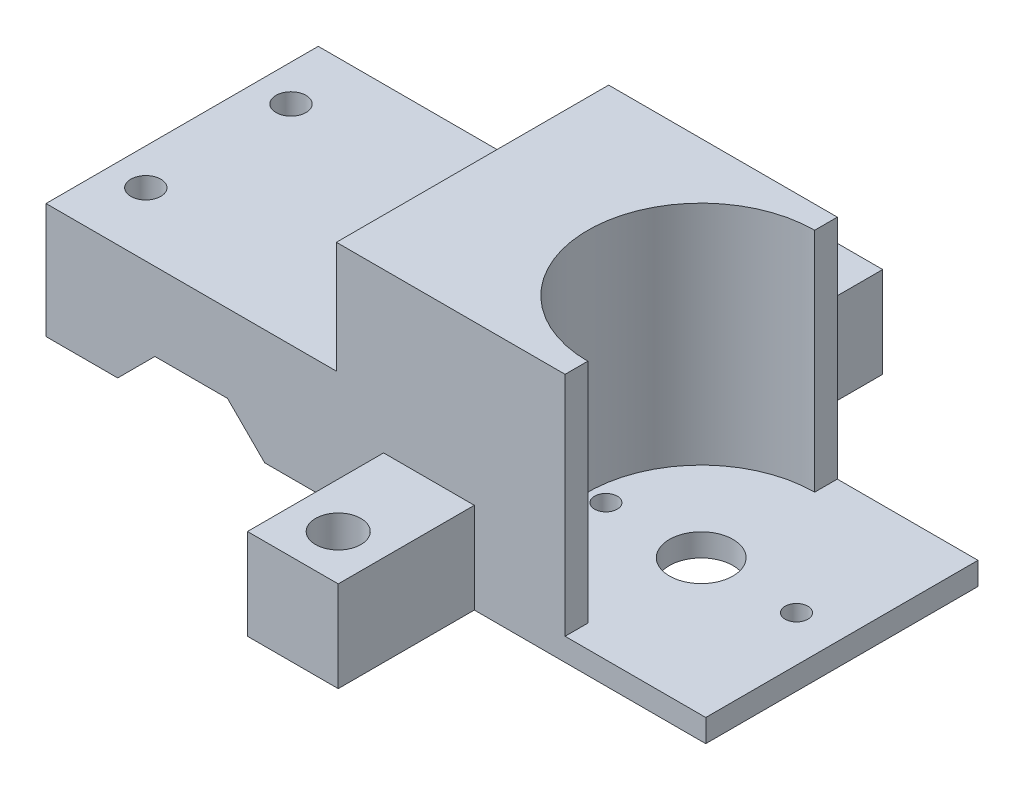
ISO-10303-21;
HEADER;
FILE_DESCRIPTION(('STEP AP214'),'2;1');
FILE_NAME('part.step','',(''),(''),'','','');
FILE_SCHEMA(('AUTOMOTIVE_DESIGN { 1 0 10303 214 1 1 1 1 }'));
ENDSEC;
DATA;
#1=APPLICATION_CONTEXT('core data for automotive mechanical design processes');
#2=APPLICATION_PROTOCOL_DEFINITION('international standard','automotive_design',2000,#1);
#3=PRODUCT_CONTEXT('',#1,'mechanical');
#4=PRODUCT('Part','Part','',(#3));
#5=PRODUCT_RELATED_PRODUCT_CATEGORY('part','',(#4));
#6=PRODUCT_DEFINITION_FORMATION('','',#4);
#7=PRODUCT_DEFINITION_CONTEXT('part definition',#1,'design');
#8=PRODUCT_DEFINITION('design','',#6,#7);
#9=PRODUCT_DEFINITION_SHAPE('','',#8);
#10=(LENGTH_UNIT() NAMED_UNIT(*) SI_UNIT(.MILLI.,.METRE.));
#11=(NAMED_UNIT(*) PLANE_ANGLE_UNIT() SI_UNIT($,.RADIAN.));
#12=(NAMED_UNIT(*) SI_UNIT($,.STERADIAN.) SOLID_ANGLE_UNIT());
#13=UNCERTAINTY_MEASURE_WITH_UNIT(LENGTH_MEASURE(1.E-05),#10,'distance_accuracy_value','');
#14=(GEOMETRIC_REPRESENTATION_CONTEXT(3) GLOBAL_UNCERTAINTY_ASSIGNED_CONTEXT((#13)) GLOBAL_UNIT_ASSIGNED_CONTEXT((#10,
#11,#12)) REPRESENTATION_CONTEXT('',''));
#15=CARTESIAN_POINT('',(0.,0.,0.));
#16=DIRECTION('',(0.,0.,1.));
#17=DIRECTION('',(1.,0.,0.));
#18=AXIS2_PLACEMENT_3D('',#15,#16,#17);
#19=CARTESIAN_POINT('',(0.,0.,-15.));
#20=DIRECTION('',(0.,0.,1.));
#21=DIRECTION('',(1.,0.,0.));
#22=AXIS2_PLACEMENT_3D('',#19,#20,#21);
#23=PLANE('',#22);
#24=DIRECTION('',(0.,-1.,0.));
#25=VECTOR('',#24,1.);
#26=CARTESIAN_POINT('',(31.2,7.49999999999998,-15.));
#27=LINE('',#26,#25);
#28=CARTESIAN_POINT('',(31.2,7.49999999999998,-15.));
#29=VERTEX_POINT('',#28);
#30=CARTESIAN_POINT('',(31.2,-2.50000000000002,-15.));
#31=VERTEX_POINT('',#30);
#32=EDGE_CURVE('E53',#29,#31,#27,.T.);
#33=ORIENTED_EDGE('',*,*,#32,.F.);
#34=DIRECTION('',(-1.,0.,0.));
#35=VECTOR('',#34,1.);
#36=CARTESIAN_POINT('',(21.2,7.49999999999999,-15.));
#37=LINE('',#36,#35);
#38=CARTESIAN_POINT('',(21.2,7.49999999999999,-15.));
#39=VERTEX_POINT('',#38);
#40=EDGE_CURVE('E58',#29,#39,#37,.T.);
#41=ORIENTED_EDGE('',*,*,#40,.T.);
#42=DIRECTION('',(0.,-1.,0.));
#43=VECTOR('',#42,1.);
#44=CARTESIAN_POINT('',(21.2,7.49999999999999,-15.));
#45=LINE('',#44,#43);
#46=CARTESIAN_POINT('',(21.2,0.,-15.));
#47=VERTEX_POINT('',#46);
#48=EDGE_CURVE('E207',#39,#47,#45,.T.);
#49=ORIENTED_EDGE('',*,*,#48,.T.);
#50=DIRECTION('',(1.,0.,0.));
#51=VECTOR('',#50,1.);
#52=CARTESIAN_POINT('',(0.,0.,-15.));
#53=LINE('',#52,#51);
#54=CARTESIAN_POINT('',(8.10121933088197,0.,-15.));
#55=VERTEX_POINT('',#54);
#56=EDGE_CURVE('E385',#55,#47,#53,.T.);
#57=ORIENTED_EDGE('',*,*,#56,.F.);
#58=DIRECTION('',(0.707106781186546,-0.707106781186549,0.));
#59=VECTOR('',#58,1.);
#60=CARTESIAN_POINT('',(4.050609665441,4.05060966544098,-15.));
#61=LINE('',#60,#59);
#62=CARTESIAN_POINT('',(4.,4.10121933088198,-15.));
#63=VERTEX_POINT('',#62);
#64=EDGE_CURVE('E383',#63,#55,#61,.T.);
#65=ORIENTED_EDGE('',*,*,#64,.F.);
#66=DIRECTION('',(1.,0.,0.));
#67=VECTOR('',#66,1.);
#68=CARTESIAN_POINT('',(0.,4.10121933088198,-15.));
#69=LINE('',#68,#67);
#70=CARTESIAN_POINT('',(-4.,4.10121933088198,-15.));
#71=VERTEX_POINT('',#70);
#72=EDGE_CURVE('E359',#71,#63,#69,.T.);
#73=ORIENTED_EDGE('',*,*,#72,.F.);
#74=DIRECTION('',(-0.707106781186546,-0.707106781186549,0.));
#75=VECTOR('',#74,1.);
#76=CARTESIAN_POINT('',(-4.050609665441,4.05060966544098,-15.));
#77=LINE('',#76,#75);
#78=CARTESIAN_POINT('',(-8.10121933088197,0.,-15.));
#79=VERTEX_POINT('',#78);
#80=EDGE_CURVE('E364',#71,#79,#77,.T.);
#81=ORIENTED_EDGE('',*,*,#80,.T.);
#82=DIRECTION('',(-1.,0.,0.));
#83=VECTOR('',#82,1.);
#84=CARTESIAN_POINT('',(0.,0.,-15.));
#85=LINE('',#84,#83);
#86=CARTESIAN_POINT('',(-16.,0.,-15.));
#87=VERTEX_POINT('',#86);
#88=EDGE_CURVE('E393',#79,#87,#85,.T.);
#89=ORIENTED_EDGE('',*,*,#88,.T.);
#90=DIRECTION('',(0.,1.,0.));
#91=VECTOR('',#90,1.);
#92=CARTESIAN_POINT('',(-16.,0.,-15.));
#93=LINE('',#92,#91);
#94=CARTESIAN_POINT('',(-16.,12.7,-15.));
#95=VERTEX_POINT('',#94);
#96=EDGE_CURVE('E390',#87,#95,#93,.T.);
#97=ORIENTED_EDGE('',*,*,#96,.T.);
#98=DIRECTION('',(-1.,0.,0.));
#99=VECTOR('',#98,1.);
#100=CARTESIAN_POINT('',(0.,12.7,-15.));
#101=LINE('',#100,#99);
#102=CARTESIAN_POINT('',(16.,12.7,-15.));
#103=VERTEX_POINT('',#102);
#104=EDGE_CURVE('E387',#103,#95,#101,.T.);
#105=ORIENTED_EDGE('',*,*,#104,.F.);
#106=DIRECTION('',(0.,1.,0.));
#107=VECTOR('',#106,1.);
#108=CARTESIAN_POINT('',(16.,0.,-15.));
#109=LINE('',#108,#107);
#110=CARTESIAN_POINT('',(16.,25.,-15.));
#111=VERTEX_POINT('',#110);
#112=EDGE_CURVE('E302',#103,#111,#109,.T.);
#113=ORIENTED_EDGE('',*,*,#112,.T.);
#114=DIRECTION('',(-1.,0.,0.));
#115=VECTOR('',#114,1.);
#116=CARTESIAN_POINT('',(41.2,25.,-15.));
#117=LINE('',#116,#115);
#118=CARTESIAN_POINT('',(41.2,25.,-15.));
#119=VERTEX_POINT('',#118);
#120=EDGE_CURVE('E332',#119,#111,#117,.T.);
#121=ORIENTED_EDGE('',*,*,#120,.F.);
#122=DIRECTION('',(0.,1.,0.));
#123=VECTOR('',#122,1.);
#124=CARTESIAN_POINT('',(41.2,0.,-15.));
#125=LINE('',#124,#123);
#126=CARTESIAN_POINT('',(41.2,0.,-15.));
#127=VERTEX_POINT('',#126);
#128=EDGE_CURVE('E309',#127,#119,#125,.T.);
#129=ORIENTED_EDGE('',*,*,#128,.F.);
#130=DIRECTION('',(1.,0.,0.));
#131=VECTOR('',#130,1.);
#132=CARTESIAN_POINT('',(21.2,0.,-15.));
#133=LINE('',#132,#131);
#134=CARTESIAN_POINT('',(56.7,0.,-15.));
#135=VERTEX_POINT('',#134);
#136=EDGE_CURVE('E287',#127,#135,#133,.T.);
#137=ORIENTED_EDGE('',*,*,#136,.T.);
#138=DIRECTION('',(0.,1.,0.));
#139=VECTOR('',#138,1.);
#140=CARTESIAN_POINT('',(56.7,-2.50000000000003,-15.));
#141=LINE('',#140,#139);
#142=CARTESIAN_POINT('',(56.7,-2.50000000000003,-15.));
#143=VERTEX_POINT('',#142);
#144=EDGE_CURVE('E295',#143,#135,#141,.T.);
#145=ORIENTED_EDGE('',*,*,#144,.F.);
#146=DIRECTION('',(1.,0.,0.));
#147=VECTOR('',#146,1.);
#148=CARTESIAN_POINT('',(21.2,-2.50000000000001,-15.));
#149=LINE('',#148,#147);
#150=EDGE_CURVE('E277',#31,#143,#149,.T.);
#151=ORIENTED_EDGE('',*,*,#150,.F.);
#152=EDGE_LOOP('',(#33,#41,#49,#57,#65,#73,#81,#89,#97,#105,#113,#121,#129,#137,#145,#151));
#153=FACE_BOUND('',#152,.T.);
#154=ADVANCED_FACE('F38',(#153),#23,.F.);
#155=CARTESIAN_POINT('',(0.,0.,15.));
#156=DIRECTION('',(0.,1.,0.));
#157=DIRECTION('',(-1.,0.,0.));
#158=AXIS2_PLACEMENT_3D('',#155,#156,#157);
#159=PLANE('',#158);
#160=CARTESIAN_POINT('',(12.,0.,-8.));
#161=DIRECTION('',(0.,-1.,0.));
#162=DIRECTION('',(1.,0.,0.));
#163=AXIS2_PLACEMENT_3D('',#160,#161,#162);
#164=CIRCLE('',#163,1.65);
#165=CARTESIAN_POINT('',(13.65,0.,-8.));
#166=VERTEX_POINT('',#165);
#167=EDGE_CURVE('E356',#166,#166,#164,.F.);
#168=ORIENTED_EDGE('',*,*,#167,.T.);
#169=EDGE_LOOP('',(#168));
#170=FACE_BOUND('',#169,.T.);
#171=CARTESIAN_POINT('',(12.,0.,8.));
#172=DIRECTION('',(0.,-1.,0.));
#173=DIRECTION('',(1.,0.,0.));
#174=AXIS2_PLACEMENT_3D('',#171,#172,#173);
#175=CIRCLE('',#174,1.65);
#176=CARTESIAN_POINT('',(13.65,0.,8.));
#177=VERTEX_POINT('',#176);
#178=EDGE_CURVE('E339',#177,#177,#175,.F.);
#179=ORIENTED_EDGE('',*,*,#178,.T.);
#180=EDGE_LOOP('',(#179));
#181=FACE_BOUND('',#180,.T.);
#182=DIRECTION('',(0.,0.,-1.));
#183=VECTOR('',#182,1.);
#184=CARTESIAN_POINT('',(21.2,0.,-15.));
#185=LINE('',#184,#183);
#186=CARTESIAN_POINT('',(21.2,0.,15.));
#187=VERTEX_POINT('',#186);
#188=EDGE_CURVE('E272',#187,#47,#185,.T.);
#189=ORIENTED_EDGE('',*,*,#188,.F.);
#190=DIRECTION('',(1.,0.,0.));
#191=VECTOR('',#190,1.);
#192=CARTESIAN_POINT('',(0.,0.,15.));
#193=LINE('',#192,#191);
#194=CARTESIAN_POINT('',(8.10121933088197,0.,15.));
#195=VERTEX_POINT('',#194);
#196=EDGE_CURVE('E366',#195,#187,#193,.T.);
#197=ORIENTED_EDGE('',*,*,#196,.F.);
#198=DIRECTION('',(0.,0.,-1.));
#199=VECTOR('',#198,1.);
#200=CARTESIAN_POINT('',(8.10121933088197,0.,15.));
#201=LINE('',#200,#199);
#202=EDGE_CURVE('E46',#195,#55,#201,.T.);
#203=ORIENTED_EDGE('',*,*,#202,.T.);
#204=ORIENTED_EDGE('',*,*,#56,.T.);
#205=EDGE_LOOP('',(#189,#197,#203,#204));
#206=FACE_BOUND('',#205,.T.);
#207=ADVANCED_FACE('F413',(#170,#181,#206),#159,.F.);
#208=CARTESIAN_POINT('',(41.2,0.,0.));
#209=DIRECTION('',(1.,0.,0.));
#210=DIRECTION('',(0.,1.,0.));
#211=AXIS2_PLACEMENT_3D('',#208,#209,#210);
#212=PLANE('',#211);
#213=DIRECTION('',(0.,1.,0.));
#214=VECTOR('',#213,1.);
#215=CARTESIAN_POINT('',(41.2,-27.9508497187474,-12.5));
#216=LINE('',#215,#214);
#217=CARTESIAN_POINT('',(41.2,0.,-12.5));
#218=VERTEX_POINT('',#217);
#219=CARTESIAN_POINT('',(41.2,25.,-12.5));
#220=VERTEX_POINT('',#219);
#221=EDGE_CURVE('E303',#218,#220,#216,.T.);
#222=ORIENTED_EDGE('',*,*,#221,.F.);
#223=DIRECTION('',(0.,0.,-1.));
#224=VECTOR('',#223,1.);
#225=CARTESIAN_POINT('',(41.2,0.,-15.));
#226=LINE('',#225,#224);
#227=EDGE_CURVE('E320',#218,#127,#226,.T.);
#228=ORIENTED_EDGE('',*,*,#227,.T.);
#229=ORIENTED_EDGE('',*,*,#128,.T.);
#230=DIRECTION('',(0.,0.,1.));
#231=VECTOR('',#230,1.);
#232=CARTESIAN_POINT('',(41.2,25.,-15.));
#233=LINE('',#232,#231);
#234=EDGE_CURVE('E314',#119,#220,#233,.T.);
#235=ORIENTED_EDGE('',*,*,#234,.T.);
#236=EDGE_LOOP('',(#222,#228,#229,#235));
#237=FACE_BOUND('',#236,.T.);
#238=ADVANCED_FACE('F451',(#237),#212,.T.);
#239=CARTESIAN_POINT('',(0.,4.10121933088198,15.));
#240=DIRECTION('',(0.,1.,0.));
#241=DIRECTION('',(0.,0.,1.));
#242=AXIS2_PLACEMENT_3D('',#239,#240,#241);
#243=PLANE('',#242);
#244=ORIENTED_EDGE('',*,*,#72,.T.);
#245=DIRECTION('',(0.,0.,-1.));
#246=VECTOR('',#245,1.);
#247=CARTESIAN_POINT('',(4.,4.10121933088198,15.));
#248=LINE('',#247,#246);
#249=CARTESIAN_POINT('',(4.,4.10121933088198,15.));
#250=VERTEX_POINT('',#249);
#251=EDGE_CURVE('E11',#250,#63,#248,.T.);
#252=ORIENTED_EDGE('',*,*,#251,.F.);
#253=DIRECTION('',(1.,0.,0.));
#254=VECTOR('',#253,1.);
#255=CARTESIAN_POINT('',(0.,4.10121933088198,15.));
#256=LINE('',#255,#254);
#257=CARTESIAN_POINT('',(-4.,4.10121933088198,15.));
#258=VERTEX_POINT('',#257);
#259=EDGE_CURVE('E360',#258,#250,#256,.T.);
#260=ORIENTED_EDGE('',*,*,#259,.F.);
#261=DIRECTION('',(0.,0.,-1.));
#262=VECTOR('',#261,1.);
#263=CARTESIAN_POINT('',(-4.,4.10121933088198,15.));
#264=LINE('',#263,#262);
#265=EDGE_CURVE('E380',#258,#71,#264,.T.);
#266=ORIENTED_EDGE('',*,*,#265,.T.);
#267=EDGE_LOOP('',(#244,#252,#260,#266));
#268=FACE_BOUND('',#267,.T.);
#269=ADVANCED_FACE('F40',(#268),#243,.F.);
#270=CARTESIAN_POINT('',(4.050609665441,4.05060966544098,15.));
#271=DIRECTION('',(0.707106781186549,0.707106781186546,0.));
#272=DIRECTION('',(-0.707106781186546,0.707106781186549,0.));
#273=AXIS2_PLACEMENT_3D('',#270,#271,#272);
#274=PLANE('',#273);
#275=ORIENTED_EDGE('',*,*,#64,.T.);
#276=ORIENTED_EDGE('',*,*,#202,.F.);
#277=DIRECTION('',(0.707106781186546,-0.707106781186549,0.));
#278=VECTOR('',#277,1.);
#279=CARTESIAN_POINT('',(4.050609665441,4.05060966544098,15.));
#280=LINE('',#279,#278);
#281=EDGE_CURVE('E363',#250,#195,#280,.T.);
#282=ORIENTED_EDGE('',*,*,#281,.F.);
#283=ORIENTED_EDGE('',*,*,#251,.T.);
#284=EDGE_LOOP('',(#275,#276,#282,#283));
#285=FACE_BOUND('',#284,.T.);
#286=ADVANCED_FACE('F418',(#285),#274,.F.);
#287=CARTESIAN_POINT('',(0.,12.7,15.));
#288=DIRECTION('',(0.,-1.,0.));
#289=DIRECTION('',(1.,0.,0.));
#290=AXIS2_PLACEMENT_3D('',#287,#288,#289);
#291=PLANE('',#290);
#292=CARTESIAN_POINT('',(-12.,12.7,-8.));
#293=DIRECTION('',(0.,1.,0.));
#294=DIRECTION('',(0.,0.,1.));
#295=AXIS2_PLACEMENT_3D('',#292,#293,#294);
#296=CIRCLE('',#295,1.65);
#297=CARTESIAN_POINT('',(-12.,12.7,-6.35));
#298=VERTEX_POINT('',#297);
#299=EDGE_CURVE('E335',#298,#298,#296,.T.);
#300=ORIENTED_EDGE('',*,*,#299,.F.);
#301=EDGE_LOOP('',(#300));
#302=FACE_BOUND('',#301,.T.);
#303=CARTESIAN_POINT('',(-12.,12.7,8.));
#304=DIRECTION('',(0.,1.,0.));
#305=DIRECTION('',(0.,0.,1.));
#306=AXIS2_PLACEMENT_3D('',#303,#304,#305);
#307=CIRCLE('',#306,1.65);
#308=CARTESIAN_POINT('',(-12.,12.7,9.65));
#309=VERTEX_POINT('',#308);
#310=EDGE_CURVE('E344',#309,#309,#307,.T.);
#311=ORIENTED_EDGE('',*,*,#310,.F.);
#312=EDGE_LOOP('',(#311));
#313=FACE_BOUND('',#312,.T.);
#314=CARTESIAN_POINT('',(12.,12.7,8.));
#315=DIRECTION('',(0.,1.,0.));
#316=DIRECTION('',(0.,0.,1.));
#317=AXIS2_PLACEMENT_3D('',#314,#315,#316);
#318=CIRCLE('',#317,1.65);
#319=CARTESIAN_POINT('',(12.,12.7,9.65));
#320=VERTEX_POINT('',#319);
#321=EDGE_CURVE('E336',#320,#320,#318,.T.);
#322=ORIENTED_EDGE('',*,*,#321,.F.);
#323=EDGE_LOOP('',(#322));
#324=FACE_BOUND('',#323,.T.);
#325=CARTESIAN_POINT('',(12.,12.7,-8.));
#326=DIRECTION('',(0.,1.,0.));
#327=DIRECTION('',(0.,0.,1.));
#328=AXIS2_PLACEMENT_3D('',#325,#326,#327);
#329=CIRCLE('',#328,1.65);
#330=CARTESIAN_POINT('',(12.,12.7,-6.35));
#331=VERTEX_POINT('',#330);
#332=EDGE_CURVE('E343',#331,#331,#329,.T.);
#333=ORIENTED_EDGE('',*,*,#332,.F.);
#334=EDGE_LOOP('',(#333));
#335=FACE_BOUND('',#334,.T.);
#336=ORIENTED_EDGE('',*,*,#104,.T.);
#337=DIRECTION('',(0.,0.,-1.));
#338=VECTOR('',#337,1.);
#339=CARTESIAN_POINT('',(-16.,12.7,15.));
#340=LINE('',#339,#338);
#341=CARTESIAN_POINT('',(-16.,12.7,15.));
#342=VERTEX_POINT('',#341);
#343=EDGE_CURVE('E403',#342,#95,#340,.T.);
#344=ORIENTED_EDGE('',*,*,#343,.F.);
#345=DIRECTION('',(-1.,0.,0.));
#346=VECTOR('',#345,1.);
#347=CARTESIAN_POINT('',(0.,12.7,15.));
#348=LINE('',#347,#346);
#349=CARTESIAN_POINT('',(16.,12.7,15.));
#350=VERTEX_POINT('',#349);
#351=EDGE_CURVE('E369',#350,#342,#348,.T.);
#352=ORIENTED_EDGE('',*,*,#351,.F.);
#353=DIRECTION('',(0.,0.,-1.));
#354=VECTOR('',#353,1.);
#355=CARTESIAN_POINT('',(16.,12.7,15.));
#356=LINE('',#355,#354);
#357=EDGE_CURVE('E405',#350,#103,#356,.T.);
#358=ORIENTED_EDGE('',*,*,#357,.T.);
#359=EDGE_LOOP('',(#336,#344,#352,#358));
#360=FACE_BOUND('',#359,.T.);
#361=ADVANCED_FACE('F436',(#302,#313,#324,#335,#360),#291,.F.);
#362=CARTESIAN_POINT('',(-16.,0.,15.));
#363=DIRECTION('',(-1.,0.,0.));
#364=DIRECTION('',(0.,-1.,0.));
#365=AXIS2_PLACEMENT_3D('',#362,#363,#364);
#366=PLANE('',#365);
#367=ORIENTED_EDGE('',*,*,#96,.F.);
#368=DIRECTION('',(0.,0.,-1.));
#369=VECTOR('',#368,1.);
#370=CARTESIAN_POINT('',(-16.,0.,15.));
#371=LINE('',#370,#369);
#372=CARTESIAN_POINT('',(-16.,0.,15.));
#373=VERTEX_POINT('',#372);
#374=EDGE_CURVE('E401',#373,#87,#371,.T.);
#375=ORIENTED_EDGE('',*,*,#374,.F.);
#376=DIRECTION('',(0.,1.,0.));
#377=VECTOR('',#376,1.);
#378=CARTESIAN_POINT('',(-16.,0.,15.));
#379=LINE('',#378,#377);
#380=EDGE_CURVE('E371',#373,#342,#379,.T.);
#381=ORIENTED_EDGE('',*,*,#380,.T.);
#382=ORIENTED_EDGE('',*,*,#343,.T.);
#383=EDGE_LOOP('',(#367,#375,#381,#382));
#384=FACE_BOUND('',#383,.T.);
#385=ADVANCED_FACE('F432',(#384),#366,.T.);
#386=CARTESIAN_POINT('',(0.,0.,15.));
#387=DIRECTION('',(0.,-1.,0.));
#388=DIRECTION('',(1.,0.,0.));
#389=AXIS2_PLACEMENT_3D('',#386,#387,#388);
#390=PLANE('',#389);
#391=CARTESIAN_POINT('',(-12.,0.,-8.));
#392=DIRECTION('',(0.,-1.,0.));
#393=DIRECTION('',(1.,0.,0.));
#394=AXIS2_PLACEMENT_3D('',#391,#392,#393);
#395=CIRCLE('',#394,1.65);
#396=CARTESIAN_POINT('',(-10.35,0.,-8.));
#397=VERTEX_POINT('',#396);
#398=EDGE_CURVE('E347',#397,#397,#395,.F.);
#399=ORIENTED_EDGE('',*,*,#398,.T.);
#400=EDGE_LOOP('',(#399));
#401=FACE_BOUND('',#400,.T.);
#402=CARTESIAN_POINT('',(-12.,0.,8.));
#403=DIRECTION('',(0.,-1.,0.));
#404=DIRECTION('',(1.,0.,0.));
#405=AXIS2_PLACEMENT_3D('',#402,#403,#404);
#406=CIRCLE('',#405,1.65);
#407=CARTESIAN_POINT('',(-10.35,0.,8.));
#408=VERTEX_POINT('',#407);
#409=EDGE_CURVE('E340',#408,#408,#406,.F.);
#410=ORIENTED_EDGE('',*,*,#409,.T.);
#411=EDGE_LOOP('',(#410));
#412=FACE_BOUND('',#411,.T.);
#413=ORIENTED_EDGE('',*,*,#88,.F.);
#414=DIRECTION('',(0.,0.,-1.));
#415=VECTOR('',#414,1.);
#416=CARTESIAN_POINT('',(-8.10121933088197,0.,15.));
#417=LINE('',#416,#415);
#418=CARTESIAN_POINT('',(-8.10121933088197,0.,15.));
#419=VERTEX_POINT('',#418);
#420=EDGE_CURVE('E399',#419,#79,#417,.T.);
#421=ORIENTED_EDGE('',*,*,#420,.F.);
#422=DIRECTION('',(-1.,0.,0.));
#423=VECTOR('',#422,1.);
#424=CARTESIAN_POINT('',(0.,0.,15.));
#425=LINE('',#424,#423);
#426=EDGE_CURVE('E374',#419,#373,#425,.T.);
#427=ORIENTED_EDGE('',*,*,#426,.T.);
#428=ORIENTED_EDGE('',*,*,#374,.T.);
#429=EDGE_LOOP('',(#413,#421,#427,#428));
#430=FACE_BOUND('',#429,.T.);
#431=ADVANCED_FACE('F428',(#401,#412,#430),#390,.T.);
#432=CARTESIAN_POINT('',(-4.050609665441,4.05060966544098,15.));
#433=DIRECTION('',(0.707106781186549,-0.707106781186546,0.));
#434=DIRECTION('',(0.707106781186546,0.707106781186549,0.));
#435=AXIS2_PLACEMENT_3D('',#432,#433,#434);
#436=PLANE('',#435);
#437=ORIENTED_EDGE('',*,*,#80,.F.);
#438=ORIENTED_EDGE('',*,*,#265,.F.);
#439=DIRECTION('',(-0.707106781186546,-0.707106781186549,0.));
#440=VECTOR('',#439,1.);
#441=CARTESIAN_POINT('',(-4.050609665441,4.05060966544098,15.));
#442=LINE('',#441,#440);
#443=EDGE_CURVE('E377',#258,#419,#442,.T.);
#444=ORIENTED_EDGE('',*,*,#443,.T.);
#445=ORIENTED_EDGE('',*,*,#420,.T.);
#446=EDGE_LOOP('',(#437,#438,#444,#445));
#447=FACE_BOUND('',#446,.T.);
#448=ADVANCED_FACE('F423',(#447),#436,.T.);
#449=CARTESIAN_POINT('',(0.,0.,15.));
#450=DIRECTION('',(0.,0.,1.));
#451=DIRECTION('',(1.,0.,0.));
#452=AXIS2_PLACEMENT_3D('',#449,#450,#451);
#453=PLANE('',#452);
#454=DIRECTION('',(0.,-1.,0.));
#455=VECTOR('',#454,1.);
#456=CARTESIAN_POINT('',(21.2,7.49999999999999,15.));
#457=LINE('',#456,#455);
#458=CARTESIAN_POINT('',(21.2,7.49999999999999,15.));
#459=VERTEX_POINT('',#458);
#460=EDGE_CURVE('E251',#459,#187,#457,.T.);
#461=ORIENTED_EDGE('',*,*,#460,.F.);
#462=DIRECTION('',(1.,0.,0.));
#463=VECTOR('',#462,1.);
#464=CARTESIAN_POINT('',(31.2,7.49999999999998,15.));
#465=LINE('',#464,#463);
#466=CARTESIAN_POINT('',(31.2,7.49999999999998,15.));
#467=VERTEX_POINT('',#466);
#468=EDGE_CURVE('E239',#459,#467,#465,.T.);
#469=ORIENTED_EDGE('',*,*,#468,.T.);
#470=DIRECTION('',(0.,-1.,0.));
#471=VECTOR('',#470,1.);
#472=CARTESIAN_POINT('',(31.2,7.49999999999998,15.));
#473=LINE('',#472,#471);
#474=CARTESIAN_POINT('',(31.2,-2.50000000000002,15.));
#475=VERTEX_POINT('',#474);
#476=EDGE_CURVE('E247',#467,#475,#473,.T.);
#477=ORIENTED_EDGE('',*,*,#476,.T.);
#478=DIRECTION('',(-1.,0.,0.));
#479=VECTOR('',#478,1.);
#480=CARTESIAN_POINT('',(21.2,-2.50000000000001,15.));
#481=LINE('',#480,#479);
#482=CARTESIAN_POINT('',(56.7,-2.50000000000003,15.));
#483=VERTEX_POINT('',#482);
#484=EDGE_CURVE('E282',#483,#475,#481,.T.);
#485=ORIENTED_EDGE('',*,*,#484,.F.);
#486=DIRECTION('',(0.,1.,0.));
#487=VECTOR('',#486,1.);
#488=CARTESIAN_POINT('',(56.7,-2.50000000000003,15.));
#489=LINE('',#488,#487);
#490=CARTESIAN_POINT('',(56.7,0.,15.));
#491=VERTEX_POINT('',#490);
#492=EDGE_CURVE('E285',#483,#491,#489,.T.);
#493=ORIENTED_EDGE('',*,*,#492,.T.);
#494=DIRECTION('',(-1.,0.,0.));
#495=VECTOR('',#494,1.);
#496=CARTESIAN_POINT('',(21.2,0.,15.));
#497=LINE('',#496,#495);
#498=CARTESIAN_POINT('',(41.2,0.,15.));
#499=VERTEX_POINT('',#498);
#500=EDGE_CURVE('E278',#491,#499,#497,.T.);
#501=ORIENTED_EDGE('',*,*,#500,.T.);
#502=DIRECTION('',(0.,-1.,0.));
#503=VECTOR('',#502,1.);
#504=CARTESIAN_POINT('',(41.2,0.,15.));
#505=LINE('',#504,#503);
#506=CARTESIAN_POINT('',(41.2,25.,15.));
#507=VERTEX_POINT('',#506);
#508=EDGE_CURVE('E317',#507,#499,#505,.T.);
#509=ORIENTED_EDGE('',*,*,#508,.F.);
#510=DIRECTION('',(-1.,0.,0.));
#511=VECTOR('',#510,1.);
#512=CARTESIAN_POINT('',(41.2,25.,15.));
#513=LINE('',#512,#511);
#514=CARTESIAN_POINT('',(16.,25.,15.));
#515=VERTEX_POINT('',#514);
#516=EDGE_CURVE('E324',#507,#515,#513,.T.);
#517=ORIENTED_EDGE('',*,*,#516,.T.);
#518=DIRECTION('',(0.,-1.,0.));
#519=VECTOR('',#518,1.);
#520=CARTESIAN_POINT('',(16.,0.,15.));
#521=LINE('',#520,#519);
#522=EDGE_CURVE('E313',#515,#350,#521,.T.);
#523=ORIENTED_EDGE('',*,*,#522,.T.);
#524=ORIENTED_EDGE('',*,*,#351,.T.);
#525=ORIENTED_EDGE('',*,*,#380,.F.);
#526=ORIENTED_EDGE('',*,*,#426,.F.);
#527=ORIENTED_EDGE('',*,*,#443,.F.);
#528=ORIENTED_EDGE('',*,*,#259,.T.);
#529=ORIENTED_EDGE('',*,*,#281,.T.);
#530=ORIENTED_EDGE('',*,*,#196,.T.);
#531=EDGE_LOOP('',(#461,#469,#477,#485,#493,#501,#509,#517,#523,#524,#525,#526,#527,#528,#529,#530));
#532=FACE_BOUND('',#531,.T.);
#533=ADVANCED_FACE('F465',(#532),#453,.T.);
#534=CARTESIAN_POINT('',(-12.,-4.66690475583122,8.));
#535=DIRECTION('',(0.,1.,0.));
#536=DIRECTION('',(0.,0.,1.));
#537=AXIS2_PLACEMENT_3D('',#534,#535,#536);
#538=CYLINDRICAL_SURFACE('',#537,1.65);
#539=ORIENTED_EDGE('',*,*,#310,.T.);
#540=EDGE_LOOP('',(#539));
#541=FACE_BOUND('',#540,.T.);
#542=ORIENTED_EDGE('',*,*,#409,.F.);
#543=EDGE_LOOP('',(#542));
#544=FACE_BOUND('',#543,.T.);
#545=ADVANCED_FACE('F544',(#541,#544),#538,.F.);
#546=CARTESIAN_POINT('',(-12.,-4.66690475583122,-8.));
#547=DIRECTION('',(0.,1.,0.));
#548=DIRECTION('',(0.,0.,1.));
#549=AXIS2_PLACEMENT_3D('',#546,#547,#548);
#550=CYLINDRICAL_SURFACE('',#549,1.65);
#551=ORIENTED_EDGE('',*,*,#299,.T.);
#552=EDGE_LOOP('',(#551));
#553=FACE_BOUND('',#552,.T.);
#554=ORIENTED_EDGE('',*,*,#398,.F.);
#555=EDGE_LOOP('',(#554));
#556=FACE_BOUND('',#555,.T.);
#557=ADVANCED_FACE('F547',(#553,#556),#550,.F.);
#558=CARTESIAN_POINT('',(12.,-4.66690475583122,-8.));
#559=DIRECTION('',(0.,1.,0.));
#560=DIRECTION('',(0.,0.,1.));
#561=AXIS2_PLACEMENT_3D('',#558,#559,#560);
#562=CYLINDRICAL_SURFACE('',#561,1.65);
#563=ORIENTED_EDGE('',*,*,#332,.T.);
#564=EDGE_LOOP('',(#563));
#565=FACE_BOUND('',#564,.T.);
#566=ORIENTED_EDGE('',*,*,#167,.F.);
#567=EDGE_LOOP('',(#566));
#568=FACE_BOUND('',#567,.T.);
#569=ADVANCED_FACE('F540',(#565,#568),#562,.F.);
#570=CARTESIAN_POINT('',(12.,-4.66690475583122,8.));
#571=DIRECTION('',(0.,1.,0.));
#572=DIRECTION('',(0.,0.,1.));
#573=AXIS2_PLACEMENT_3D('',#570,#571,#572);
#574=CYLINDRICAL_SURFACE('',#573,1.65);
#575=ORIENTED_EDGE('',*,*,#321,.T.);
#576=EDGE_LOOP('',(#575));
#577=FACE_BOUND('',#576,.T.);
#578=ORIENTED_EDGE('',*,*,#178,.F.);
#579=EDGE_LOOP('',(#578));
#580=FACE_BOUND('',#579,.T.);
#581=ADVANCED_FACE('F535',(#577,#580),#574,.F.);
#582=CARTESIAN_POINT('',(41.2,25.,-15.));
#583=DIRECTION('',(0.,-1.,0.));
#584=DIRECTION('',(1.,0.,0.));
#585=AXIS2_PLACEMENT_3D('',#582,#583,#584);
#586=PLANE('',#585);
#587=CARTESIAN_POINT('',(41.2,25.,12.5));
#588=VERTEX_POINT('',#587);
#589=EDGE_CURVE('E312',#588,#507,#233,.T.);
#590=ORIENTED_EDGE('',*,*,#589,.F.);
#591=CARTESIAN_POINT('',(41.2,25.,0.));
#592=DIRECTION('',(0.,1.,0.));
#593=DIRECTION('',(-1.,0.,0.));
#594=AXIS2_PLACEMENT_3D('',#591,#592,#593);
#595=CIRCLE('',#594,12.5);
#596=EDGE_CURVE('E298',#220,#588,#595,.T.);
#597=ORIENTED_EDGE('',*,*,#596,.F.);
#598=ORIENTED_EDGE('',*,*,#234,.F.);
#599=ORIENTED_EDGE('',*,*,#120,.T.);
#600=DIRECTION('',(0.,0.,1.));
#601=VECTOR('',#600,1.);
#602=CARTESIAN_POINT('',(16.,25.,-15.));
#603=LINE('',#602,#601);
#604=EDGE_CURVE('E326',#111,#515,#603,.T.);
#605=ORIENTED_EDGE('',*,*,#604,.T.);
#606=ORIENTED_EDGE('',*,*,#516,.F.);
#607=EDGE_LOOP('',(#590,#597,#598,#599,#605,#606));
#608=FACE_BOUND('',#607,.T.);
#609=ADVANCED_FACE('F446',(#608),#586,.F.);
#610=DIRECTION('',(0.,1.,0.));
#611=VECTOR('',#610,1.);
#612=CARTESIAN_POINT('',(41.2,-27.9508497187474,12.5));
#613=LINE('',#612,#611);
#614=CARTESIAN_POINT('',(41.2,0.,12.5));
#615=VERTEX_POINT('',#614);
#616=EDGE_CURVE('E305',#615,#588,#613,.T.);
#617=ORIENTED_EDGE('',*,*,#616,.T.);
#618=ORIENTED_EDGE('',*,*,#589,.T.);
#619=ORIENTED_EDGE('',*,*,#508,.T.);
#620=EDGE_CURVE('E321',#499,#615,#226,.T.);
#621=ORIENTED_EDGE('',*,*,#620,.T.);
#622=EDGE_LOOP('',(#617,#618,#619,#621));
#623=FACE_BOUND('',#622,.T.);
#624=ADVANCED_FACE('F468',(#623),#212,.T.);
#625=CARTESIAN_POINT('',(16.,0.,0.));
#626=DIRECTION('',(1.,0.,0.));
#627=DIRECTION('',(0.,1.,0.));
#628=AXIS2_PLACEMENT_3D('',#625,#626,#627);
#629=PLANE('',#628);
#630=ORIENTED_EDGE('',*,*,#357,.F.);
#631=ORIENTED_EDGE('',*,*,#522,.F.);
#632=ORIENTED_EDGE('',*,*,#604,.F.);
#633=ORIENTED_EDGE('',*,*,#112,.F.);
#634=EDGE_LOOP('',(#630,#631,#632,#633));
#635=FACE_BOUND('',#634,.T.);
#636=ADVANCED_FACE('F442',(#635),#629,.F.);
#637=CARTESIAN_POINT('',(41.2,-27.9508497187474,0.));
#638=DIRECTION('',(0.,1.,0.));
#639=DIRECTION('',(-1.,0.,0.));
#640=AXIS2_PLACEMENT_3D('',#637,#638,#639);
#641=CYLINDRICAL_SURFACE('',#640,12.5);
#642=CARTESIAN_POINT('',(41.2,0.,0.));
#643=DIRECTION('',(0.,1.,0.));
#644=DIRECTION('',(-1.,0.,0.));
#645=AXIS2_PLACEMENT_3D('',#642,#643,#644);
#646=CIRCLE('',#645,12.5);
#647=EDGE_CURVE('E299',#615,#218,#646,.F.);
#648=ORIENTED_EDGE('',*,*,#647,.T.);
#649=ORIENTED_EDGE('',*,*,#221,.T.);
#650=ORIENTED_EDGE('',*,*,#596,.T.);
#651=ORIENTED_EDGE('',*,*,#616,.F.);
#652=EDGE_LOOP('',(#648,#649,#650,#651));
#653=FACE_BOUND('',#652,.T.);
#654=ADVANCED_FACE('F534',(#653),#641,.F.);
#655=CARTESIAN_POINT('',(0.,-2.5,0.));
#656=DIRECTION('',(0.,1.,0.));
#657=DIRECTION('',(-1.,0.,0.));
#658=AXIS2_PLACEMENT_3D('',#655,#656,#657);
#659=PLANE('',#658);
#660=DIRECTION('',(0.,0.,-1.));
#661=VECTOR('',#660,1.);
#662=CARTESIAN_POINT('',(21.2,-2.50000000000001,-15.));
#663=LINE('',#662,#661);
#664=CARTESIAN_POINT('',(21.2,-2.50000000000001,30.));
#665=VERTEX_POINT('',#664);
#666=CARTESIAN_POINT('',(21.2,-2.50000000000001,-30.));
#667=VERTEX_POINT('',#666);
#668=EDGE_CURVE('E275',#665,#667,#663,.T.);
#669=ORIENTED_EDGE('',*,*,#668,.T.);
#670=DIRECTION('',(1.,0.,0.));
#671=VECTOR('',#670,1.);
#672=CARTESIAN_POINT('',(21.2,-2.50000000000001,-30.));
#673=LINE('',#672,#671);
#674=CARTESIAN_POINT('',(31.2,-2.50000000000002,-30.));
#675=VERTEX_POINT('',#674);
#676=EDGE_CURVE('E193',#667,#675,#673,.T.);
#677=ORIENTED_EDGE('',*,*,#676,.T.);
#678=DIRECTION('',(0.,0.,1.));
#679=VECTOR('',#678,1.);
#680=CARTESIAN_POINT('',(31.2,-2.50000000000002,-15.));
#681=LINE('',#680,#679);
#682=EDGE_CURVE('E208',#675,#31,#681,.T.);
#683=ORIENTED_EDGE('',*,*,#682,.T.);
#684=ORIENTED_EDGE('',*,*,#150,.T.);
#685=DIRECTION('',(0.,0.,1.));
#686=VECTOR('',#685,1.);
#687=CARTESIAN_POINT('',(56.7,-2.50000000000003,-15.));
#688=LINE('',#687,#686);
#689=EDGE_CURVE('E280',#143,#483,#688,.T.);
#690=ORIENTED_EDGE('',*,*,#689,.T.);
#691=ORIENTED_EDGE('',*,*,#484,.T.);
#692=DIRECTION('',(0.,0.,1.));
#693=VECTOR('',#692,1.);
#694=CARTESIAN_POINT('',(31.2,-2.50000000000002,30.));
#695=LINE('',#694,#693);
#696=CARTESIAN_POINT('',(31.2,-2.50000000000002,30.));
#697=VERTEX_POINT('',#696);
#698=EDGE_CURVE('E227',#475,#697,#695,.T.);
#699=ORIENTED_EDGE('',*,*,#698,.T.);
#700=DIRECTION('',(-1.,0.,0.));
#701=VECTOR('',#700,1.);
#702=CARTESIAN_POINT('',(31.2,-2.50000000000002,30.));
#703=LINE('',#702,#701);
#704=EDGE_CURVE('E234',#697,#665,#703,.T.);
#705=ORIENTED_EDGE('',*,*,#704,.T.);
#706=EDGE_LOOP('',(#669,#677,#683,#684,#690,#691,#699,#705));
#707=FACE_BOUND('',#706,.T.);
#708=CARTESIAN_POINT('',(41.2,-2.50000000000002,0.));
#709=DIRECTION('',(0.,-1.,0.));
#710=DIRECTION('',(1.,0.,0.));
#711=AXIS2_PLACEMENT_3D('',#708,#709,#710);
#712=CIRCLE('',#711,3.5);
#713=CARTESIAN_POINT('',(44.7,-2.50000000000002,0.));
#714=VERTEX_POINT('',#713);
#715=EDGE_CURVE('E269',#714,#714,#712,.T.);
#716=ORIENTED_EDGE('',*,*,#715,.F.);
#717=EDGE_LOOP('',(#716));
#718=FACE_BOUND('',#717,.T.);
#719=CARTESIAN_POINT('',(51.7,-2.50000000000003,0.));
#720=DIRECTION('',(0.,-1.,0.));
#721=DIRECTION('',(1.,0.,0.));
#722=AXIS2_PLACEMENT_3D('',#719,#720,#721);
#723=CIRCLE('',#722,1.25);
#724=CARTESIAN_POINT('',(52.95,-2.50000000000003,0.));
#725=VERTEX_POINT('',#724);
#726=EDGE_CURVE('E263',#725,#725,#723,.T.);
#727=ORIENTED_EDGE('',*,*,#726,.F.);
#728=EDGE_LOOP('',(#727));
#729=FACE_BOUND('',#728,.T.);
#730=CARTESIAN_POINT('',(30.7,-2.50000000000002,0.));
#731=DIRECTION('',(0.,-1.,0.));
#732=DIRECTION('',(1.,0.,0.));
#733=AXIS2_PLACEMENT_3D('',#730,#731,#732);
#734=CIRCLE('',#733,1.25);
#735=CARTESIAN_POINT('',(31.95,-2.50000000000002,0.));
#736=VERTEX_POINT('',#735);
#737=EDGE_CURVE('E257',#736,#736,#734,.T.);
#738=ORIENTED_EDGE('',*,*,#737,.F.);
#739=EDGE_LOOP('',(#738));
#740=FACE_BOUND('',#739,.T.);
#741=CARTESIAN_POINT('',(26.2,-2.50000000000001,25.));
#742=DIRECTION('',(0.,-1.,0.));
#743=DIRECTION('',(1.,0.,0.));
#744=AXIS2_PLACEMENT_3D('',#741,#742,#743);
#745=CIRCLE('',#744,2.5);
#746=CARTESIAN_POINT('',(28.7,-2.50000000000002,25.));
#747=VERTEX_POINT('',#746);
#748=EDGE_CURVE('E221',#747,#747,#745,.T.);
#749=ORIENTED_EDGE('',*,*,#748,.F.);
#750=EDGE_LOOP('',(#749));
#751=FACE_BOUND('',#750,.T.);
#752=CARTESIAN_POINT('',(26.2,-2.50000000000001,-25.));
#753=DIRECTION('',(0.,-1.,0.));
#754=DIRECTION('',(1.,0.,0.));
#755=AXIS2_PLACEMENT_3D('',#752,#753,#754);
#756=CIRCLE('',#755,2.5);
#757=CARTESIAN_POINT('',(28.7,-2.50000000000002,-25.));
#758=VERTEX_POINT('',#757);
#759=EDGE_CURVE('E213',#758,#758,#756,.T.);
#760=ORIENTED_EDGE('',*,*,#759,.F.);
#761=EDGE_LOOP('',(#760));
#762=FACE_BOUND('',#761,.T.);
#763=ADVANCED_FACE('F480',(#707,#718,#729,#740,#751,#762),#659,.F.);
#764=CARTESIAN_POINT('',(0.,0.,0.));
#765=DIRECTION('',(0.,1.,0.));
#766=DIRECTION('',(-1.,0.,0.));
#767=AXIS2_PLACEMENT_3D('',#764,#765,#766);
#768=PLANE('',#767);
#769=ORIENTED_EDGE('',*,*,#136,.F.);
#770=ORIENTED_EDGE('',*,*,#227,.F.);
#771=ORIENTED_EDGE('',*,*,#647,.F.);
#772=ORIENTED_EDGE('',*,*,#620,.F.);
#773=ORIENTED_EDGE('',*,*,#500,.F.);
#774=DIRECTION('',(0.,0.,1.));
#775=VECTOR('',#774,1.);
#776=CARTESIAN_POINT('',(56.7,0.,-15.));
#777=LINE('',#776,#775);
#778=EDGE_CURVE('E289',#135,#491,#777,.T.);
#779=ORIENTED_EDGE('',*,*,#778,.F.);
#780=EDGE_LOOP('',(#769,#770,#771,#772,#773,#779));
#781=FACE_BOUND('',#780,.T.);
#782=CARTESIAN_POINT('',(51.7,0.,0.));
#783=DIRECTION('',(0.,-1.,0.));
#784=DIRECTION('',(1.,0.,0.));
#785=AXIS2_PLACEMENT_3D('',#782,#783,#784);
#786=CIRCLE('',#785,1.25);
#787=CARTESIAN_POINT('',(52.95,0.,0.));
#788=VERTEX_POINT('',#787);
#789=EDGE_CURVE('E260',#788,#788,#786,.T.);
#790=ORIENTED_EDGE('',*,*,#789,.T.);
#791=EDGE_LOOP('',(#790));
#792=FACE_BOUND('',#791,.T.);
#793=CARTESIAN_POINT('',(41.2,0.,0.));
#794=DIRECTION('',(0.,-1.,0.));
#795=DIRECTION('',(1.,0.,0.));
#796=AXIS2_PLACEMENT_3D('',#793,#794,#795);
#797=CIRCLE('',#796,3.5);
#798=CARTESIAN_POINT('',(44.7,0.,0.));
#799=VERTEX_POINT('',#798);
#800=EDGE_CURVE('E266',#799,#799,#797,.T.);
#801=ORIENTED_EDGE('',*,*,#800,.T.);
#802=EDGE_LOOP('',(#801));
#803=FACE_BOUND('',#802,.T.);
#804=CARTESIAN_POINT('',(30.7,0.,0.));
#805=DIRECTION('',(0.,-1.,0.));
#806=DIRECTION('',(1.,0.,0.));
#807=AXIS2_PLACEMENT_3D('',#804,#805,#806);
#808=CIRCLE('',#807,1.25);
#809=CARTESIAN_POINT('',(31.95,0.,0.));
#810=VERTEX_POINT('',#809);
#811=EDGE_CURVE('E250',#810,#810,#808,.T.);
#812=ORIENTED_EDGE('',*,*,#811,.T.);
#813=EDGE_LOOP('',(#812));
#814=FACE_BOUND('',#813,.T.);
#815=ADVANCED_FACE('F460',(#781,#792,#803,#814),#768,.T.);
#816=CARTESIAN_POINT('',(21.2,-2.50000000000001,-15.));
#817=DIRECTION('',(1.,0.,0.));
#818=DIRECTION('',(0.,1.,0.));
#819=AXIS2_PLACEMENT_3D('',#816,#817,#818);
#820=PLANE('',#819);
#821=ORIENTED_EDGE('',*,*,#188,.T.);
#822=ORIENTED_EDGE('',*,*,#48,.F.);
#823=DIRECTION('',(0.,0.,-1.));
#824=VECTOR('',#823,1.);
#825=CARTESIAN_POINT('',(21.2,7.49999999999999,-15.));
#826=LINE('',#825,#824);
#827=CARTESIAN_POINT('',(21.2,7.49999999999999,-30.));
#828=VERTEX_POINT('',#827);
#829=EDGE_CURVE('E202',#39,#828,#826,.T.);
#830=ORIENTED_EDGE('',*,*,#829,.T.);
#831=DIRECTION('',(0.,-1.,0.));
#832=VECTOR('',#831,1.);
#833=CARTESIAN_POINT('',(21.2,7.49999999999999,-30.));
#834=LINE('',#833,#832);
#835=EDGE_CURVE('E188',#828,#667,#834,.T.);
#836=ORIENTED_EDGE('',*,*,#835,.T.);
#837=ORIENTED_EDGE('',*,*,#668,.F.);
#838=DIRECTION('',(0.,-1.,0.));
#839=VECTOR('',#838,1.);
#840=CARTESIAN_POINT('',(21.2,7.49999999999999,30.));
#841=LINE('',#840,#839);
#842=CARTESIAN_POINT('',(21.2,7.49999999999999,30.));
#843=VERTEX_POINT('',#842);
#844=EDGE_CURVE('E253',#843,#665,#841,.T.);
#845=ORIENTED_EDGE('',*,*,#844,.F.);
#846=DIRECTION('',(0.,0.,-1.));
#847=VECTOR('',#846,1.);
#848=CARTESIAN_POINT('',(21.2,7.49999999999999,30.));
#849=LINE('',#848,#847);
#850=EDGE_CURVE('E237',#843,#459,#849,.T.);
#851=ORIENTED_EDGE('',*,*,#850,.T.);
#852=ORIENTED_EDGE('',*,*,#460,.T.);
#853=EDGE_LOOP('',(#821,#822,#830,#836,#837,#845,#851,#852));
#854=FACE_BOUND('',#853,.T.);
#855=ADVANCED_FACE('F206',(#854),#820,.F.);
#856=CARTESIAN_POINT('',(56.7,-2.50000000000003,-15.));
#857=DIRECTION('',(-1.,0.,0.));
#858=DIRECTION('',(0.,-1.,0.));
#859=AXIS2_PLACEMENT_3D('',#856,#857,#858);
#860=PLANE('',#859);
#861=ORIENTED_EDGE('',*,*,#778,.T.);
#862=ORIENTED_EDGE('',*,*,#492,.F.);
#863=ORIENTED_EDGE('',*,*,#689,.F.);
#864=ORIENTED_EDGE('',*,*,#144,.T.);
#865=EDGE_LOOP('',(#861,#862,#863,#864));
#866=FACE_BOUND('',#865,.T.);
#867=ADVANCED_FACE('F457',(#866),#860,.F.);
#868=CARTESIAN_POINT('',(41.2,-2.50000000000002,0.));
#869=DIRECTION('',(0.,1.,0.));
#870=DIRECTION('',(-1.,0.,0.));
#871=AXIS2_PLACEMENT_3D('',#868,#869,#870);
#872=CYLINDRICAL_SURFACE('',#871,3.5);
#873=ORIENTED_EDGE('',*,*,#715,.T.);
#874=EDGE_LOOP('',(#873));
#875=FACE_BOUND('',#874,.T.);
#876=ORIENTED_EDGE('',*,*,#800,.F.);
#877=EDGE_LOOP('',(#876));
#878=FACE_BOUND('',#877,.T.);
#879=ADVANCED_FACE('F625',(#875,#878),#872,.F.);
#880=CARTESIAN_POINT('',(51.7,-2.50000000000003,0.));
#881=DIRECTION('',(0.,1.,0.));
#882=DIRECTION('',(-1.,0.,0.));
#883=AXIS2_PLACEMENT_3D('',#880,#881,#882);
#884=CYLINDRICAL_SURFACE('',#883,1.25);
#885=ORIENTED_EDGE('',*,*,#726,.T.);
#886=EDGE_LOOP('',(#885));
#887=FACE_BOUND('',#886,.T.);
#888=ORIENTED_EDGE('',*,*,#789,.F.);
#889=EDGE_LOOP('',(#888));
#890=FACE_BOUND('',#889,.T.);
#891=ADVANCED_FACE('F634',(#887,#890),#884,.F.);
#892=CARTESIAN_POINT('',(30.7,-2.50000000000002,0.));
#893=DIRECTION('',(0.,1.,0.));
#894=DIRECTION('',(-1.,0.,0.));
#895=AXIS2_PLACEMENT_3D('',#892,#893,#894);
#896=CYLINDRICAL_SURFACE('',#895,1.25);
#897=ORIENTED_EDGE('',*,*,#737,.T.);
#898=EDGE_LOOP('',(#897));
#899=FACE_BOUND('',#898,.T.);
#900=ORIENTED_EDGE('',*,*,#811,.F.);
#901=EDGE_LOOP('',(#900));
#902=FACE_BOUND('',#901,.T.);
#903=ADVANCED_FACE('F496',(#899,#902),#896,.F.);
#904=CARTESIAN_POINT('',(31.2,7.49999999999998,30.));
#905=DIRECTION('',(1.,0.,0.));
#906=DIRECTION('',(0.,1.,0.));
#907=AXIS2_PLACEMENT_3D('',#904,#905,#906);
#908=PLANE('',#907);
#909=ORIENTED_EDGE('',*,*,#698,.F.);
#910=ORIENTED_EDGE('',*,*,#476,.F.);
#911=DIRECTION('',(0.,0.,1.));
#912=VECTOR('',#911,1.);
#913=CARTESIAN_POINT('',(31.2,7.49999999999998,30.));
#914=LINE('',#913,#912);
#915=CARTESIAN_POINT('',(31.2,7.49999999999998,30.));
#916=VERTEX_POINT('',#915);
#917=EDGE_CURVE('E230',#467,#916,#914,.T.);
#918=ORIENTED_EDGE('',*,*,#917,.T.);
#919=DIRECTION('',(0.,-1.,0.));
#920=VECTOR('',#919,1.);
#921=CARTESIAN_POINT('',(31.2,7.49999999999998,30.));
#922=LINE('',#921,#920);
#923=EDGE_CURVE('E242',#916,#697,#922,.T.);
#924=ORIENTED_EDGE('',*,*,#923,.T.);
#925=EDGE_LOOP('',(#909,#910,#918,#924));
#926=FACE_BOUND('',#925,.T.);
#927=ADVANCED_FACE('F477',(#926),#908,.T.);
#928=CARTESIAN_POINT('',(31.2,7.49999999999998,30.));
#929=DIRECTION('',(0.,0.,1.));
#930=DIRECTION('',(1.,0.,0.));
#931=AXIS2_PLACEMENT_3D('',#928,#929,#930);
#932=PLANE('',#931);
#933=ORIENTED_EDGE('',*,*,#704,.F.);
#934=ORIENTED_EDGE('',*,*,#923,.F.);
#935=DIRECTION('',(-1.,0.,0.));
#936=VECTOR('',#935,1.);
#937=CARTESIAN_POINT('',(31.2,7.49999999999998,30.));
#938=LINE('',#937,#936);
#939=EDGE_CURVE('E233',#916,#843,#938,.T.);
#940=ORIENTED_EDGE('',*,*,#939,.T.);
#941=ORIENTED_EDGE('',*,*,#844,.T.);
#942=EDGE_LOOP('',(#933,#934,#940,#941));
#943=FACE_BOUND('',#942,.T.);
#944=ADVANCED_FACE('F486',(#943),#932,.T.);
#945=CARTESIAN_POINT('',(0.,7.5,0.));
#946=DIRECTION('',(0.,1.,0.));
#947=DIRECTION('',(-1.,0.,0.));
#948=AXIS2_PLACEMENT_3D('',#945,#946,#947);
#949=PLANE('',#948);
#950=CARTESIAN_POINT('',(26.2,7.49999999999999,25.));
#951=DIRECTION('',(0.,-1.,0.));
#952=DIRECTION('',(1.,0.,0.));
#953=AXIS2_PLACEMENT_3D('',#950,#951,#952);
#954=CIRCLE('',#953,2.5);
#955=CARTESIAN_POINT('',(28.7,7.49999999999998,25.));
#956=VERTEX_POINT('',#955);
#957=EDGE_CURVE('E224',#956,#956,#954,.T.);
#958=ORIENTED_EDGE('',*,*,#957,.T.);
#959=EDGE_LOOP('',(#958));
#960=FACE_BOUND('',#959,.T.);
#961=ORIENTED_EDGE('',*,*,#917,.F.);
#962=ORIENTED_EDGE('',*,*,#468,.F.);
#963=ORIENTED_EDGE('',*,*,#850,.F.);
#964=ORIENTED_EDGE('',*,*,#939,.F.);
#965=EDGE_LOOP('',(#961,#962,#963,#964));
#966=FACE_BOUND('',#965,.T.);
#967=ADVANCED_FACE('F475',(#960,#966),#949,.T.);
#968=CARTESIAN_POINT('',(26.2,7.49999999999999,25.));
#969=DIRECTION('',(0.,-1.,0.));
#970=DIRECTION('',(1.,0.,0.));
#971=AXIS2_PLACEMENT_3D('',#968,#969,#970);
#972=CYLINDRICAL_SURFACE('',#971,2.5);
#973=ORIENTED_EDGE('',*,*,#957,.F.);
#974=EDGE_LOOP('',(#973));
#975=FACE_BOUND('',#974,.T.);
#976=ORIENTED_EDGE('',*,*,#748,.T.);
#977=EDGE_LOOP('',(#976));
#978=FACE_BOUND('',#977,.T.);
#979=ADVANCED_FACE('F493',(#975,#978),#972,.F.);
#980=CARTESIAN_POINT('',(31.2,7.49999999999998,-15.));
#981=DIRECTION('',(1.,0.,0.));
#982=DIRECTION('',(0.,1.,0.));
#983=AXIS2_PLACEMENT_3D('',#980,#981,#982);
#984=PLANE('',#983);
#985=ORIENTED_EDGE('',*,*,#682,.F.);
#986=DIRECTION('',(0.,-1.,0.));
#987=VECTOR('',#986,1.);
#988=CARTESIAN_POINT('',(31.2,7.49999999999998,-30.));
#989=LINE('',#988,#987);
#990=CARTESIAN_POINT('',(31.2,7.49999999999998,-30.));
#991=VERTEX_POINT('',#990);
#992=EDGE_CURVE('E196',#991,#675,#989,.T.);
#993=ORIENTED_EDGE('',*,*,#992,.F.);
#994=DIRECTION('',(0.,0.,1.));
#995=VECTOR('',#994,1.);
#996=CARTESIAN_POINT('',(31.2,7.49999999999998,-15.));
#997=LINE('',#996,#995);
#998=EDGE_CURVE('E203',#991,#29,#997,.T.);
#999=ORIENTED_EDGE('',*,*,#998,.T.);
#1000=ORIENTED_EDGE('',*,*,#32,.T.);
#1001=EDGE_LOOP('',(#985,#993,#999,#1000));
#1002=FACE_BOUND('',#1001,.T.);
#1003=ADVANCED_FACE('F484',(#1002),#984,.T.);
#1004=CARTESIAN_POINT('',(21.2,7.49999999999999,-30.));
#1005=DIRECTION('',(0.,0.,-1.));
#1006=DIRECTION('',(-1.,0.,0.));
#1007=AXIS2_PLACEMENT_3D('',#1004,#1005,#1006);
#1008=PLANE('',#1007);
#1009=ORIENTED_EDGE('',*,*,#676,.F.);
#1010=ORIENTED_EDGE('',*,*,#835,.F.);
#1011=DIRECTION('',(1.,0.,0.));
#1012=VECTOR('',#1011,1.);
#1013=CARTESIAN_POINT('',(21.2,7.49999999999999,-30.));
#1014=LINE('',#1013,#1012);
#1015=EDGE_CURVE('E191',#828,#991,#1014,.T.);
#1016=ORIENTED_EDGE('',*,*,#1015,.T.);
#1017=ORIENTED_EDGE('',*,*,#992,.T.);
#1018=EDGE_LOOP('',(#1009,#1010,#1016,#1017));
#1019=FACE_BOUND('',#1018,.T.);
#1020=ADVANCED_FACE('F190',(#1019),#1008,.T.);
#1021=CARTESIAN_POINT('',(0.,7.5,0.));
#1022=DIRECTION('',(0.,-1.,0.));
#1023=DIRECTION('',(1.,0.,0.));
#1024=AXIS2_PLACEMENT_3D('',#1021,#1022,#1023);
#1025=PLANE('',#1024);
#1026=CARTESIAN_POINT('',(26.2,7.49999999999999,-25.));
#1027=DIRECTION('',(0.,-1.,0.));
#1028=DIRECTION('',(1.,0.,0.));
#1029=AXIS2_PLACEMENT_3D('',#1026,#1027,#1028);
#1030=CIRCLE('',#1029,2.5);
#1031=CARTESIAN_POINT('',(28.7,7.49999999999998,-25.));
#1032=VERTEX_POINT('',#1031);
#1033=EDGE_CURVE('E218',#1032,#1032,#1030,.T.);
#1034=ORIENTED_EDGE('',*,*,#1033,.T.);
#1035=EDGE_LOOP('',(#1034));
#1036=FACE_BOUND('',#1035,.T.);
#1037=ORIENTED_EDGE('',*,*,#829,.F.);
#1038=ORIENTED_EDGE('',*,*,#40,.F.);
#1039=ORIENTED_EDGE('',*,*,#998,.F.);
#1040=ORIENTED_EDGE('',*,*,#1015,.F.);
#1041=EDGE_LOOP('',(#1037,#1038,#1039,#1040));
#1042=FACE_BOUND('',#1041,.T.);
#1043=ADVANCED_FACE('F201',(#1036,#1042),#1025,.F.);
#1044=CARTESIAN_POINT('',(26.2,7.49999999999999,-25.));
#1045=DIRECTION('',(0.,-1.,0.));
#1046=DIRECTION('',(1.,0.,0.));
#1047=AXIS2_PLACEMENT_3D('',#1044,#1045,#1046);
#1048=CYLINDRICAL_SURFACE('',#1047,2.5);
#1049=ORIENTED_EDGE('',*,*,#1033,.F.);
#1050=EDGE_LOOP('',(#1049));
#1051=FACE_BOUND('',#1050,.T.);
#1052=ORIENTED_EDGE('',*,*,#759,.T.);
#1053=EDGE_LOOP('',(#1052));
#1054=FACE_BOUND('',#1053,.T.);
#1055=ADVANCED_FACE('F738',(#1051,#1054),#1048,.F.);
#1056=CLOSED_SHELL('',(#154,#207,#238,#269,#286,#361,#385,#431,#448,#533,#545,#557,#569,#581,
#609,#624,#636,#654,#763,#815,#855,#867,#879,#891,#903,#927,#944,#967,#979,#1003,#1020,#1043,#1055));
#1057=MANIFOLD_SOLID_BREP('B2',#1056);
#1058=ADVANCED_BREP_SHAPE_REPRESENTATION('',(#18,#1057),#14);
#1059=SHAPE_DEFINITION_REPRESENTATION(#9,#1058);
ENDSEC;
END-ISO-10303-21;
